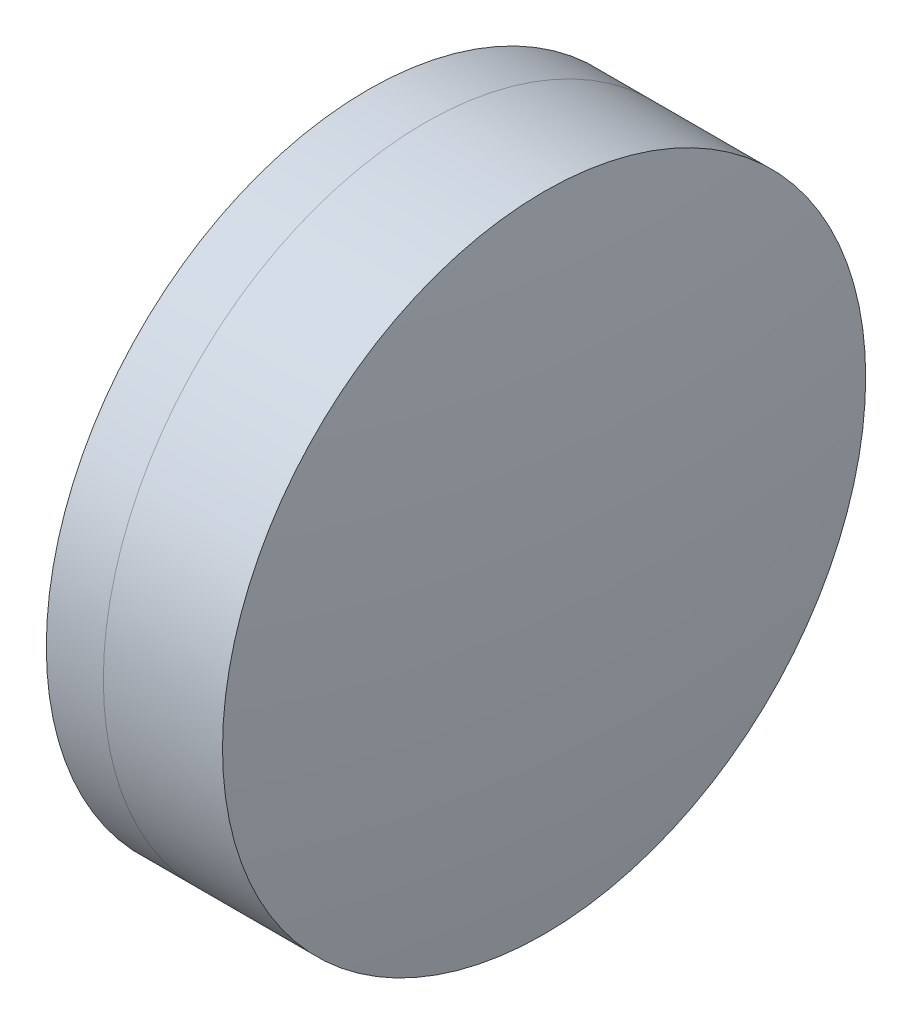
ISO-10303-21;
HEADER;
FILE_DESCRIPTION(('STEP AP214'),'2;1');
FILE_NAME('part.step','',(''),(''),'','','');
FILE_SCHEMA(('AUTOMOTIVE_DESIGN { 1 0 10303 214 1 1 1 1 }'));
ENDSEC;
DATA;
#1=APPLICATION_CONTEXT('core data for automotive mechanical design processes');
#2=APPLICATION_PROTOCOL_DEFINITION('international standard','automotive_design',2000,#1);
#3=PRODUCT_CONTEXT('',#1,'mechanical');
#4=PRODUCT('Part','Part','',(#3));
#5=PRODUCT_RELATED_PRODUCT_CATEGORY('part','',(#4));
#6=PRODUCT_DEFINITION_FORMATION('','',#4);
#7=PRODUCT_DEFINITION_CONTEXT('part definition',#1,'design');
#8=PRODUCT_DEFINITION('design','',#6,#7);
#9=PRODUCT_DEFINITION_SHAPE('','',#8);
#10=(LENGTH_UNIT() NAMED_UNIT(*) SI_UNIT(.MILLI.,.METRE.));
#11=(NAMED_UNIT(*) PLANE_ANGLE_UNIT() SI_UNIT($,.RADIAN.));
#12=(NAMED_UNIT(*) SI_UNIT($,.STERADIAN.) SOLID_ANGLE_UNIT());
#13=UNCERTAINTY_MEASURE_WITH_UNIT(LENGTH_MEASURE(1.E-05),#10,'distance_accuracy_value','');
#14=(GEOMETRIC_REPRESENTATION_CONTEXT(3) GLOBAL_UNCERTAINTY_ASSIGNED_CONTEXT((#13)) GLOBAL_UNIT_ASSIGNED_CONTEXT((#10,
#11,#12)) REPRESENTATION_CONTEXT('',''));
#15=CARTESIAN_POINT('',(0.,0.,0.));
#16=DIRECTION('',(0.,0.,1.));
#17=DIRECTION('',(1.,0.,0.));
#18=AXIS2_PLACEMENT_3D('',#15,#16,#17);
#19=CARTESIAN_POINT('',(14.8796689735747,0.,0.));
#20=DIRECTION('',(-1.,0.,0.));
#21=DIRECTION('',(0.,0.,1.));
#22=AXIS2_PLACEMENT_3D('',#19,#20,#21);
#23=SPHERICAL_SURFACE('',#22,22.28);
#24=CARTESIAN_POINT('',(33.3227815091529,0.,0.));
#25=DIRECTION('',(-1.,0.,0.));
#26=DIRECTION('',(0.,0.,1.));
#27=AXIS2_PLACEMENT_3D('',#24,#25,#26);
#28=CIRCLE('',#27,12.5);
#29=CARTESIAN_POINT('',(33.3227815091529,0.,12.5));
#30=VERTEX_POINT('',#29);
#31=EDGE_CURVE('E11',#30,#30,#28,.T.);
#32=ORIENTED_EDGE('',*,*,#31,.T.);
#33=EDGE_LOOP('',(#32));
#34=FACE_BOUND('',#33,.T.);
#35=ADVANCED_FACE('F45',(#34),#23,.F.);
#36=CARTESIAN_POINT('',(-0.551919992657797,0.,0.));
#37=DIRECTION('',(-1.,0.,0.));
#38=DIRECTION('',(0.,0.,1.));
#39=AXIS2_PLACEMENT_3D('',#36,#37,#38);
#40=CYLINDRICAL_SURFACE('',#39,12.5);
#41=CARTESIAN_POINT('',(37.9550670026433,0.,0.));
#42=DIRECTION('',(-1.,0.,0.));
#43=DIRECTION('',(0.,0.,1.));
#44=AXIS2_PLACEMENT_3D('',#41,#42,#43);
#45=CIRCLE('',#44,12.5);
#46=CARTESIAN_POINT('',(37.9550670026433,0.,12.5));
#47=VERTEX_POINT('',#46);
#48=EDGE_CURVE('E51',#47,#47,#45,.T.);
#49=ORIENTED_EDGE('',*,*,#48,.T.);
#50=EDGE_LOOP('',(#49));
#51=FACE_BOUND('',#50,.T.);
#52=ORIENTED_EDGE('',*,*,#31,.F.);
#53=EDGE_LOOP('',(#52));
#54=FACE_BOUND('',#53,.T.);
#55=ADVANCED_FACE('F57',(#51,#54),#40,.T.);
#56=CARTESIAN_POINT('',(-58.7403310264253,0.,0.));
#57=DIRECTION('',(-1.,0.,0.));
#58=DIRECTION('',(0.,0.,1.));
#59=AXIS2_PLACEMENT_3D('',#56,#57,#58);
#60=SPHERICAL_SURFACE('',#59,97.5);
#61=ORIENTED_EDGE('',*,*,#48,.F.);
#62=EDGE_LOOP('',(#61));
#63=FACE_BOUND('',#62,.T.);
#64=ADVANCED_FACE('F60',(#63),#60,.T.);
#65=CLOSED_SHELL('',(#35,#55,#64));
#66=MANIFOLD_SOLID_BREP('B2',#65);
#67=CARTESIAN_POINT('',(57.1296689735747,0.,0.));
#68=DIRECTION('',(-1.,0.,0.));
#69=DIRECTION('',(0.,0.,-1.));
#70=AXIS2_PLACEMENT_3D('',#67,#68,#69);
#71=SPHERICAL_SURFACE('',#70,28.87);
#72=CARTESIAN_POINT('',(31.1060854386347,0.,0.));
#73=DIRECTION('',(-1.,0.,0.));
#74=DIRECTION('',(0.,0.,1.));
#75=AXIS2_PLACEMENT_3D('',#72,#73,#74);
#76=CIRCLE('',#75,12.5);
#77=CARTESIAN_POINT('',(31.1060854386347,0.,12.5));
#78=VERTEX_POINT('',#77);
#79=EDGE_CURVE('E44',#78,#78,#76,.T.);
#80=ORIENTED_EDGE('',*,*,#79,.T.);
#81=EDGE_LOOP('',(#80));
#82=FACE_BOUND('',#81,.T.);
#83=ADVANCED_FACE('F86',(#82),#71,.T.);
#84=CARTESIAN_POINT('',(-9.70261217833668,0.,0.));
#85=DIRECTION('',(-1.,0.,0.));
#86=DIRECTION('',(0.,0.,1.));
#87=AXIS2_PLACEMENT_3D('',#84,#85,#86);
#88=CYLINDRICAL_SURFACE('',#87,12.5);
#89=CARTESIAN_POINT('',(33.3227815091529,0.,0.));
#90=DIRECTION('',(-1.,0.,0.));
#91=DIRECTION('',(0.,0.,1.));
#92=AXIS2_PLACEMENT_3D('',#89,#90,#91);
#93=CIRCLE('',#92,12.5);
#94=CARTESIAN_POINT('',(33.3227815091529,0.,12.5));
#95=VERTEX_POINT('',#94);
#96=EDGE_CURVE('E92',#95,#95,#93,.T.);
#97=ORIENTED_EDGE('',*,*,#96,.T.);
#98=EDGE_LOOP('',(#97));
#99=FACE_BOUND('',#98,.T.);
#100=ORIENTED_EDGE('',*,*,#79,.F.);
#101=EDGE_LOOP('',(#100));
#102=FACE_BOUND('',#101,.T.);
#103=ADVANCED_FACE('F98',(#99,#102),#88,.T.);
#104=CARTESIAN_POINT('',(14.8796689735747,0.,0.));
#105=DIRECTION('',(-1.,0.,0.));
#106=DIRECTION('',(0.,0.,1.));
#107=AXIS2_PLACEMENT_3D('',#104,#105,#106);
#108=SPHERICAL_SURFACE('',#107,22.28);
#109=ORIENTED_EDGE('',*,*,#96,.F.);
#110=EDGE_LOOP('',(#109));
#111=FACE_BOUND('',#110,.T.);
#112=ADVANCED_FACE('F101',(#111),#108,.T.);
#113=CLOSED_SHELL('',(#83,#103,#112));
#114=MANIFOLD_SOLID_BREP('B6',#113);
#115=ADVANCED_BREP_SHAPE_REPRESENTATION('',(#18,#66,#114),#14);
#116=SHAPE_DEFINITION_REPRESENTATION(#9,#115);
ENDSEC;
END-ISO-10303-21;
